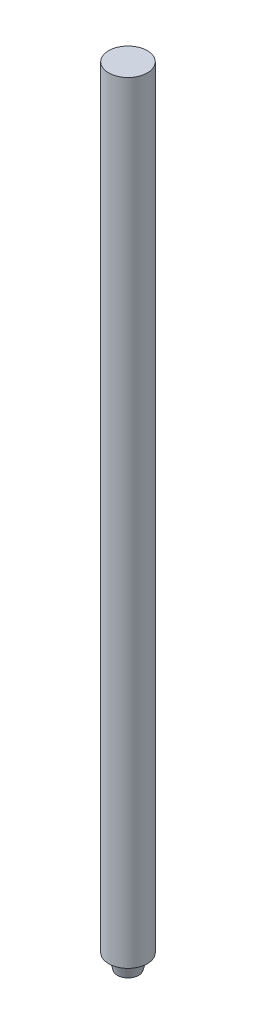
ISO-10303-21;
HEADER;
FILE_DESCRIPTION(('STEP AP214'),'2;1');
FILE_NAME('part.step','',(''),(''),'','','');
FILE_SCHEMA(('AUTOMOTIVE_DESIGN { 1 0 10303 214 1 1 1 1 }'));
ENDSEC;
DATA;
#1=APPLICATION_CONTEXT('core data for automotive mechanical design processes');
#2=APPLICATION_PROTOCOL_DEFINITION('international standard','automotive_design',2000,#1);
#3=PRODUCT_CONTEXT('',#1,'mechanical');
#4=PRODUCT('Part','Part','',(#3));
#5=PRODUCT_RELATED_PRODUCT_CATEGORY('part','',(#4));
#6=PRODUCT_DEFINITION_FORMATION('','',#4);
#7=PRODUCT_DEFINITION_CONTEXT('part definition',#1,'design');
#8=PRODUCT_DEFINITION('design','',#6,#7);
#9=PRODUCT_DEFINITION_SHAPE('','',#8);
#10=(LENGTH_UNIT() NAMED_UNIT(*) SI_UNIT(.MILLI.,.METRE.));
#11=(NAMED_UNIT(*) PLANE_ANGLE_UNIT() SI_UNIT($,.RADIAN.));
#12=(NAMED_UNIT(*) SI_UNIT($,.STERADIAN.) SOLID_ANGLE_UNIT());
#13=UNCERTAINTY_MEASURE_WITH_UNIT(LENGTH_MEASURE(1.E-05),#10,'distance_accuracy_value','');
#14=(GEOMETRIC_REPRESENTATION_CONTEXT(3) GLOBAL_UNCERTAINTY_ASSIGNED_CONTEXT((#13)) GLOBAL_UNIT_ASSIGNED_CONTEXT((#10,
#11,#12)) REPRESENTATION_CONTEXT('',''));
#15=CARTESIAN_POINT('',(0.,0.,0.));
#16=DIRECTION('',(0.,0.,1.));
#17=DIRECTION('',(1.,0.,0.));
#18=AXIS2_PLACEMENT_3D('',#15,#16,#17);
#19=CARTESIAN_POINT('',(0.,-159.86,0.));
#20=DIRECTION('',(0.,1.,0.));
#21=DIRECTION('',(0.,0.,1.));
#22=AXIS2_PLACEMENT_3D('',#19,#20,#21);
#23=PLANE('',#22);
#24=CARTESIAN_POINT('',(0.,-159.86,0.));
#25=DIRECTION('',(0.,1.,0.));
#26=DIRECTION('',(0.,0.,1.));
#27=AXIS2_PLACEMENT_3D('',#24,#25,#26);
#28=CIRCLE('',#27,4.);
#29=CARTESIAN_POINT('',(0.,-159.86,4.));
#30=VERTEX_POINT('',#29);
#31=EDGE_CURVE('E35',#30,#30,#28,.T.);
#32=ORIENTED_EDGE('',*,*,#31,.F.);
#33=EDGE_LOOP('',(#32));
#34=FACE_BOUND('',#33,.T.);
#35=CARTESIAN_POINT('',(0.,-159.86,0.));
#36=DIRECTION('',(0.,1.,0.));
#37=DIRECTION('',(0.,0.,1.));
#38=AXIS2_PLACEMENT_3D('',#35,#36,#37);
#39=CIRCLE('',#38,3.);
#40=CARTESIAN_POINT('',(0.,-159.86,3.));
#41=VERTEX_POINT('',#40);
#42=EDGE_CURVE('E10',#41,#41,#39,.F.);
#43=ORIENTED_EDGE('',*,*,#42,.F.);
#44=EDGE_LOOP('',(#43));
#45=FACE_BOUND('',#44,.T.);
#46=ADVANCED_FACE('F28',(#34,#45),#23,.F.);
#47=CARTESIAN_POINT('',(0.,-159.86,0.));
#48=DIRECTION('',(0.,1.,0.));
#49=DIRECTION('',(0.,0.,1.));
#50=AXIS2_PLACEMENT_3D('',#47,#48,#49);
#51=CYLINDRICAL_SURFACE('',#50,4.);
#52=ORIENTED_EDGE('',*,*,#31,.T.);
#53=EDGE_LOOP('',(#52));
#54=FACE_BOUND('',#53,.T.);
#55=CARTESIAN_POINT('',(0.,0.,0.));
#56=DIRECTION('',(0.,1.,0.));
#57=DIRECTION('',(0.,0.,1.));
#58=AXIS2_PLACEMENT_3D('',#55,#56,#57);
#59=CIRCLE('',#58,4.);
#60=CARTESIAN_POINT('',(0.,0.,4.));
#61=VERTEX_POINT('',#60);
#62=EDGE_CURVE('E39',#61,#61,#59,.T.);
#63=ORIENTED_EDGE('',*,*,#62,.F.);
#64=EDGE_LOOP('',(#63));
#65=FACE_BOUND('',#64,.T.);
#66=ADVANCED_FACE('F30',(#54,#65),#51,.T.);
#67=CARTESIAN_POINT('',(0.,0.,0.));
#68=DIRECTION('',(0.,1.,0.));
#69=DIRECTION('',(0.,0.,1.));
#70=AXIS2_PLACEMENT_3D('',#67,#68,#69);
#71=PLANE('',#70);
#72=ORIENTED_EDGE('',*,*,#62,.T.);
#73=EDGE_LOOP('',(#72));
#74=FACE_BOUND('',#73,.T.);
#75=ADVANCED_FACE('F53',(#74),#71,.T.);
#76=CARTESIAN_POINT('',(0.,-159.86,0.));
#77=DIRECTION('',(0.,1.,0.));
#78=DIRECTION('',(0.,0.,-1.));
#79=AXIS2_PLACEMENT_3D('',#76,#77,#78);
#80=CONICAL_SURFACE('',#79,3.,0.26179938779915);
#81=CARTESIAN_POINT('',(0.,-162.86,0.));
#82=DIRECTION('',(0.,-1.,0.));
#83=DIRECTION('',(0.,0.,-1.));
#84=AXIS2_PLACEMENT_3D('',#81,#82,#83);
#85=CIRCLE('',#84,2.19615242270663);
#86=CARTESIAN_POINT('',(0.,-162.86,-2.19615242270663));
#87=VERTEX_POINT('',#86);
#88=EDGE_CURVE('E44',#87,#87,#85,.T.);
#89=ORIENTED_EDGE('',*,*,#88,.F.);
#90=EDGE_LOOP('',(#89));
#91=FACE_BOUND('',#90,.T.);
#92=ORIENTED_EDGE('',*,*,#42,.T.);
#93=EDGE_LOOP('',(#92));
#94=FACE_BOUND('',#93,.T.);
#95=ADVANCED_FACE('F51',(#91,#94),#80,.T.);
#96=CARTESIAN_POINT('',(0.,-162.86,0.));
#97=DIRECTION('',(0.,-1.,0.));
#98=DIRECTION('',(0.,0.,-1.));
#99=AXIS2_PLACEMENT_3D('',#96,#97,#98);
#100=PLANE('',#99);
#101=ORIENTED_EDGE('',*,*,#88,.T.);
#102=EDGE_LOOP('',(#101));
#103=FACE_BOUND('',#102,.T.);
#104=ADVANCED_FACE('F49',(#103),#100,.T.);
#105=CLOSED_SHELL('',(#46,#66,#75,#95,#104));
#106=MANIFOLD_SOLID_BREP('B2',#105);
#107=ADVANCED_BREP_SHAPE_REPRESENTATION('',(#18,#106),#14);
#108=SHAPE_DEFINITION_REPRESENTATION(#9,#107);
ENDSEC;
END-ISO-10303-21;
